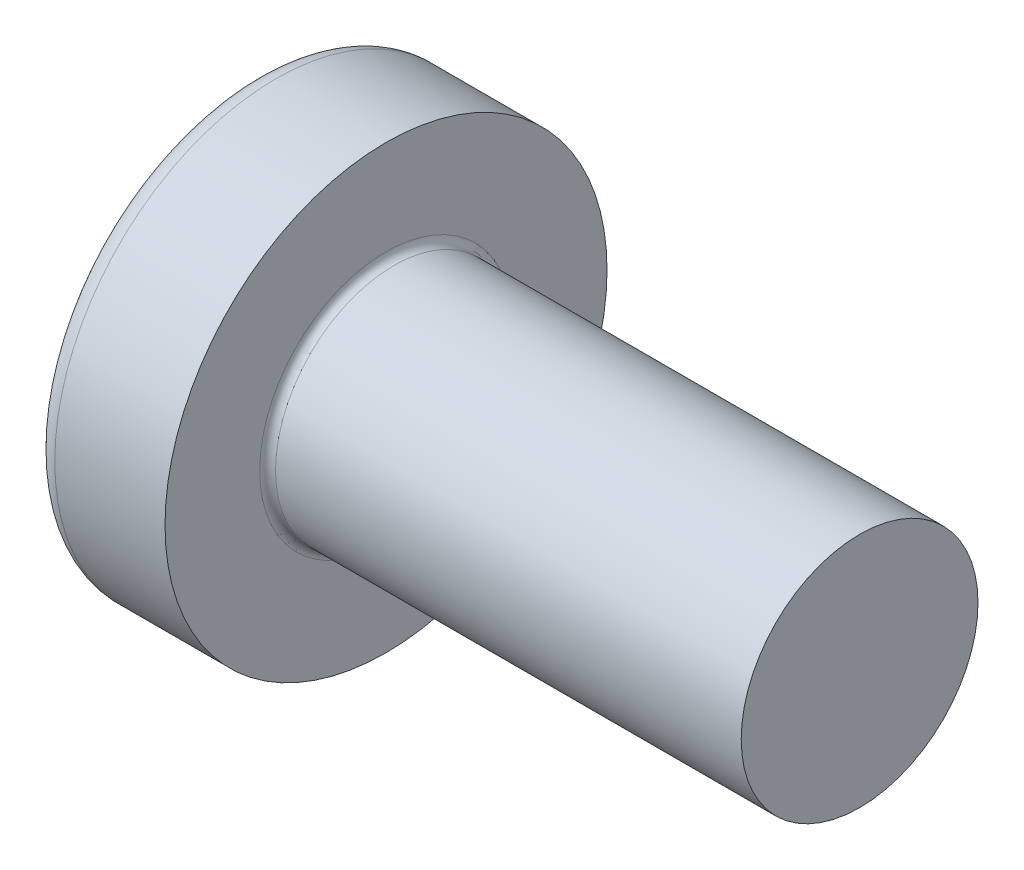
ISO-10303-21;
HEADER;
FILE_DESCRIPTION(('STEP AP214'),'2;1');
FILE_NAME('part.step','',(''),(''),'','','');
FILE_SCHEMA(('AUTOMOTIVE_DESIGN { 1 0 10303 214 1 1 1 1 }'));
ENDSEC;
DATA;
#1=APPLICATION_CONTEXT('core data for automotive mechanical design processes');
#2=APPLICATION_PROTOCOL_DEFINITION('international standard','automotive_design',2000,#1);
#3=PRODUCT_CONTEXT('',#1,'mechanical');
#4=PRODUCT('Part','Part','',(#3));
#5=PRODUCT_RELATED_PRODUCT_CATEGORY('part','',(#4));
#6=PRODUCT_DEFINITION_FORMATION('','',#4);
#7=PRODUCT_DEFINITION_CONTEXT('part definition',#1,'design');
#8=PRODUCT_DEFINITION('design','',#6,#7);
#9=PRODUCT_DEFINITION_SHAPE('','',#8);
#10=(LENGTH_UNIT() NAMED_UNIT(*) SI_UNIT(.MILLI.,.METRE.));
#11=(NAMED_UNIT(*) PLANE_ANGLE_UNIT() SI_UNIT($,.RADIAN.));
#12=(NAMED_UNIT(*) SI_UNIT($,.STERADIAN.) SOLID_ANGLE_UNIT());
#13=UNCERTAINTY_MEASURE_WITH_UNIT(LENGTH_MEASURE(1.E-05),#10,'distance_accuracy_value','');
#14=(GEOMETRIC_REPRESENTATION_CONTEXT(3) GLOBAL_UNCERTAINTY_ASSIGNED_CONTEXT((#13)) GLOBAL_UNIT_ASSIGNED_CONTEXT((#10,
#11,#12)) REPRESENTATION_CONTEXT('',''));
#15=CARTESIAN_POINT('',(0.,0.,0.));
#16=DIRECTION('',(0.,0.,1.));
#17=DIRECTION('',(1.,0.,0.));
#18=AXIS2_PLACEMENT_3D('',#15,#16,#17);
#19=CARTESIAN_POINT('',(5.,0.,0.));
#20=DIRECTION('',(-1.,0.,0.));
#21=DIRECTION('',(0.,1.,0.));
#22=AXIS2_PLACEMENT_3D('',#19,#20,#21);
#23=SPHERICAL_SURFACE('',#22,5.);
#24=CARTESIAN_POINT('',(0.775371598933733,0.,0.));
#25=DIRECTION('',(-1.,0.,0.));
#26=DIRECTION('',(0.,0.,1.));
#27=AXIS2_PLACEMENT_3D('',#24,#25,#26);
#28=CIRCLE('',#27,2.67441860465116);
#29=CARTESIAN_POINT('',(0.775371598933733,0.,2.67441860465116));
#30=VERTEX_POINT('',#29);
#31=EDGE_CURVE('E243',#30,#30,#28,.T.);
#32=ORIENTED_EDGE('',*,*,#31,.T.);
#33=EDGE_LOOP('',(#32));
#34=FACE_BOUND('',#33,.T.);
#35=CARTESIAN_POINT('',(0.0457951200896417,0.,0.));
#36=DIRECTION('',(1.,0.,0.));
#37=DIRECTION('',(0.,0.,-1.));
#38=AXIS2_PLACEMENT_3D('',#35,#36,#37);
#39=CIRCLE('',#38,0.675169614150692);
#40=CARTESIAN_POINT('',(0.0457951200896426,-0.369999999999998,-0.564760133040918));
#41=VERTEX_POINT('',#40);
#42=CARTESIAN_POINT('',(0.0457951200896417,-0.564760133040916,-0.37));
#43=VERTEX_POINT('',#42);
#44=EDGE_CURVE('E379',#41,#43,#39,.F.);
#45=ORIENTED_EDGE('',*,*,#44,.F.);
#46=CARTESIAN_POINT('',(5.,-0.37,0.));
#47=DIRECTION('',(0.,1.,0.));
#48=DIRECTION('',(0.,0.,1.));
#49=AXIS2_PLACEMENT_3D('',#46,#47,#48);
#50=CIRCLE('',#49,4.98629120689917);
#51=CARTESIAN_POINT('',(0.187869731256034,-0.369999999999995,-1.30633161051784));
#52=VERTEX_POINT('',#51);
#53=EDGE_CURVE('E305',#52,#41,#50,.T.);
#54=ORIENTED_EDGE('',*,*,#53,.F.);
#55=CARTESIAN_POINT('',(4.56358245832426,0.,0.875318202045668));
#56=DIRECTION('',(0.446197800778958,0.,-0.89493436774996));
#57=DIRECTION('',(-0.89493436774996,0.,-0.446197800778958));
#58=AXIS2_PLACEMENT_3D('',#55,#56,#57);
#59=CIRCLE('',#58,4.90340267309195);
#60=CARTESIAN_POINT('',(0.187869731256035,0.370000000000005,-1.30633161051784));
#61=VERTEX_POINT('',#60);
#62=EDGE_CURVE('E277',#52,#61,#59,.T.);
#63=ORIENTED_EDGE('',*,*,#62,.T.);
#64=CARTESIAN_POINT('',(5.,0.37,0.));
#65=DIRECTION('',(0.,-1.,0.));
#66=DIRECTION('',(0.,0.,-1.));
#67=AXIS2_PLACEMENT_3D('',#64,#65,#66);
#68=CIRCLE('',#67,4.98629120689917);
#69=CARTESIAN_POINT('',(0.0457951200896421,0.370000000000002,-0.564760133040916));
#70=VERTEX_POINT('',#69);
#71=EDGE_CURVE('E332',#70,#61,#68,.T.);
#72=ORIENTED_EDGE('',*,*,#71,.F.);
#73=CARTESIAN_POINT('',(0.0457951200896417,0.564760133040915,-0.37));
#74=VERTEX_POINT('',#73);
#75=EDGE_CURVE('E398',#74,#70,#39,.F.);
#76=ORIENTED_EDGE('',*,*,#75,.F.);
#77=CARTESIAN_POINT('',(5.,0.,-0.37));
#78=DIRECTION('',(0.,0.,1.));
#79=DIRECTION('',(1.,0.,0.));
#80=AXIS2_PLACEMENT_3D('',#77,#78,#79);
#81=CIRCLE('',#80,4.98629120689917);
#82=CARTESIAN_POINT('',(0.187869731256034,1.30633161051784,-0.37));
#83=VERTEX_POINT('',#82);
#84=EDGE_CURVE('E271',#83,#74,#81,.T.);
#85=ORIENTED_EDGE('',*,*,#84,.F.);
#86=CARTESIAN_POINT('',(4.56358245832426,-0.875318202045668,0.));
#87=DIRECTION('',(0.446197800778958,0.894934367749961,0.));
#88=DIRECTION('',(-0.89493436774996,0.446197800778958,0.));
#89=AXIS2_PLACEMENT_3D('',#86,#87,#88);
#90=CIRCLE('',#89,4.90340267309195);
#91=CARTESIAN_POINT('',(0.187869731256034,1.30633161051784,0.37));
#92=VERTEX_POINT('',#91);
#93=EDGE_CURVE('E274',#83,#92,#90,.T.);
#94=ORIENTED_EDGE('',*,*,#93,.T.);
#95=CARTESIAN_POINT('',(5.,0.,0.37));
#96=DIRECTION('',(0.,0.,-1.));
#97=DIRECTION('',(0.,1.,0.));
#98=AXIS2_PLACEMENT_3D('',#95,#96,#97);
#99=CIRCLE('',#98,4.98629120689917);
#100=CARTESIAN_POINT('',(0.0457951200896417,0.564760133040915,0.37));
#101=VERTEX_POINT('',#100);
#102=EDGE_CURVE('E267',#101,#92,#99,.T.);
#103=ORIENTED_EDGE('',*,*,#102,.F.);
#104=CARTESIAN_POINT('',(0.0457951200896426,0.369999999999998,0.564760133040918));
#105=VERTEX_POINT('',#104);
#106=EDGE_CURVE('E397',#105,#101,#39,.F.);
#107=ORIENTED_EDGE('',*,*,#106,.F.);
#108=CARTESIAN_POINT('',(0.187869731256033,0.369999999999995,1.30633161051784));
#109=VERTEX_POINT('',#108);
#110=EDGE_CURVE('E287',#109,#105,#68,.T.);
#111=ORIENTED_EDGE('',*,*,#110,.F.);
#112=CARTESIAN_POINT('',(4.56358245832426,0.,-0.875318202045669));
#113=DIRECTION('',(0.446197800778958,0.,0.894934367749961));
#114=DIRECTION('',(0.89493436774996,0.,-0.446197800778958));
#115=AXIS2_PLACEMENT_3D('',#112,#113,#114);
#116=CIRCLE('',#115,4.90340267309195);
#117=CARTESIAN_POINT('',(0.187869731256034,-0.370000000000005,1.30633161051784));
#118=VERTEX_POINT('',#117);
#119=EDGE_CURVE('E54',#109,#118,#116,.T.);
#120=ORIENTED_EDGE('',*,*,#119,.T.);
#121=CARTESIAN_POINT('',(0.0457951200896421,-0.370000000000002,0.564760133040916));
#122=VERTEX_POINT('',#121);
#123=EDGE_CURVE('E284',#122,#118,#50,.T.);
#124=ORIENTED_EDGE('',*,*,#123,.F.);
#125=CARTESIAN_POINT('',(0.0457951200896417,-0.564760133040916,0.37));
#126=VERTEX_POINT('',#125);
#127=EDGE_CURVE('E433',#126,#122,#39,.F.);
#128=ORIENTED_EDGE('',*,*,#127,.F.);
#129=CARTESIAN_POINT('',(0.187869731256033,-1.30633161051784,0.37));
#130=VERTEX_POINT('',#129);
#131=EDGE_CURVE('E268',#130,#126,#99,.T.);
#132=ORIENTED_EDGE('',*,*,#131,.F.);
#133=CARTESIAN_POINT('',(4.56358245832426,0.875318202045668,0.));
#134=DIRECTION('',(0.446197800778958,-0.89493436774996,0.));
#135=DIRECTION('',(0.89493436774996,0.446197800778958,0.));
#136=AXIS2_PLACEMENT_3D('',#133,#134,#135);
#137=CIRCLE('',#136,4.90340267309195);
#138=CARTESIAN_POINT('',(0.187869731256033,-1.30633161051784,-0.37));
#139=VERTEX_POINT('',#138);
#140=EDGE_CURVE('E264',#130,#139,#137,.T.);
#141=ORIENTED_EDGE('',*,*,#140,.T.);
#142=EDGE_CURVE('E69',#43,#139,#81,.T.);
#143=ORIENTED_EDGE('',*,*,#142,.F.);
#144=EDGE_LOOP('',(#45,#54,#63,#72,#76,#85,#94,#103,#107,#111,#120,#124,#128,#132,#141,#143));
#145=FACE_BOUND('',#144,.T.);
#146=ADVANCED_FACE('F41',(#34,#145),#23,.T.);
#147=CARTESIAN_POINT('',(1.75,0.527482216012805,-0.37));
#148=DIRECTION('',(0.,0.,1.));
#149=DIRECTION('',(1.,0.,0.));
#150=AXIS2_PLACEMENT_3D('',#147,#148,#149);
#151=PLANE('',#150);
#152=ORIENTED_EDGE('',*,*,#84,.T.);
#153=CARTESIAN_POINT('',(-0.987293237053716,0.649401255967161,-0.37));
#154=CARTESIAN_POINT('',(-0.781914975317084,0.632865887002871,-0.37));
#155=CARTESIAN_POINT('',(-0.576547882393372,0.616188977635081,-0.37));
#156=CARTESIAN_POINT('',(-0.165841599226327,0.582441031964227,-0.37));
#157=CARTESIAN_POINT('',(0.0394975903090452,0.56536998705488,-0.37));
#158=CARTESIAN_POINT('',(0.450133475422572,0.530723441326535,-0.37));
#159=CARTESIAN_POINT('',(0.655430171010573,0.513147940624557,-0.37));
#160=CARTESIAN_POINT('',(1.06596140177934,0.477314957985794,-0.37));
#161=CARTESIAN_POINT('',(1.2711959378071,0.459057485806066,-0.37));
#162=CARTESIAN_POINT('',(1.61065292365626,0.428051938688768,-0.37));
#163=CARTESIAN_POINT('',(1.74490059995643,0.415580824990931,-0.37));
#164=CARTESIAN_POINT('',(2.01334321762763,0.390092023404979,-0.37));
#165=CARTESIAN_POINT('',(2.14753815934577,0.377074339177353,-0.37));
#166=CARTESIAN_POINT('',(2.41586354151957,0.350315629452843,-0.37));
#167=CARTESIAN_POINT('',(2.5499939784531,0.33657456817765,-0.37));
#168=CARTESIAN_POINT('',(2.81814173295471,0.308004077741875,-0.37));
#169=CARTESIAN_POINT('',(2.95215904765134,0.293174621747065,-0.37));
#170=CARTESIAN_POINT('',(3.0860955068368,0.277618485071816,-0.37));
#171=B_SPLINE_CURVE_WITH_KNOTS('',3,(#153,#154,#155,#156,#157,#158,#159,#160,#161,#162,#163,
#164,#165,#166,#167,#168,#169,#170),.UNSPECIFIED.,.F.,.F.,(4,2,2,2,2,2,2,2,4),(0.,
0.618128793984691,1.23627109812525,1.85441325887562,2.4725465791681,2.87702276218609,
3.28149623678161,3.68598973550942,4.09049321032311),.UNSPECIFIED.);
#172=CARTESIAN_POINT('',(1.75,0.415013252800437,-0.370000000000001));
#173=VERTEX_POINT('',#172);
#174=EDGE_CURVE('E419',#74,#173,#171,.T.);
#175=ORIENTED_EDGE('',*,*,#174,.T.);
#176=DIRECTION('',(0.,1.,0.));
#177=VECTOR('',#176,1.);
#178=CARTESIAN_POINT('',(1.75,-0.527482216012805,-0.37));
#179=LINE('',#178,#177);
#180=CARTESIAN_POINT('',(1.75,0.527482216012805,-0.37));
#181=VERTEX_POINT('',#180);
#182=EDGE_CURVE('E361',#173,#181,#179,.T.);
#183=ORIENTED_EDGE('',*,*,#182,.T.);
#184=DIRECTION('',(0.89493436774996,-0.446197800778958,0.));
#185=VECTOR('',#184,1.);
#186=CARTESIAN_POINT('',(0.,1.4,-0.37));
#187=LINE('',#186,#185);
#188=EDGE_CURVE('E244',#83,#181,#187,.T.);
#189=ORIENTED_EDGE('',*,*,#188,.F.);
#190=EDGE_LOOP('',(#152,#175,#183,#189));
#191=FACE_BOUND('',#190,.T.);
#192=ADVANCED_FACE('F199',(#191),#151,.T.);
#193=CARTESIAN_POINT('',(1.75,-0.527482216012805,-0.37));
#194=VERTEX_POINT('',#193);
#195=CARTESIAN_POINT('',(1.75,-0.415013252800437,-0.370000000000001));
#196=VERTEX_POINT('',#195);
#197=EDGE_CURVE('E252',#194,#196,#179,.T.);
#198=ORIENTED_EDGE('',*,*,#197,.T.);
#199=CARTESIAN_POINT('',(-0.987293237053716,-0.649401255967161,-0.37));
#200=CARTESIAN_POINT('',(-0.781914975317084,-0.632865887002871,-0.37));
#201=CARTESIAN_POINT('',(-0.576547882393372,-0.616188977635081,-0.37));
#202=CARTESIAN_POINT('',(-0.165841599226327,-0.582441031964227,-0.37));
#203=CARTESIAN_POINT('',(0.0394975903090452,-0.56536998705488,-0.37));
#204=CARTESIAN_POINT('',(0.450133475422572,-0.530723441326535,-0.37));
#205=CARTESIAN_POINT('',(0.655430171010573,-0.513147940624557,-0.37));
#206=CARTESIAN_POINT('',(1.06596140177934,-0.477314957985794,-0.37));
#207=CARTESIAN_POINT('',(1.2711959378071,-0.459057485806066,-0.37));
#208=CARTESIAN_POINT('',(1.61065292365626,-0.428051938688768,-0.37));
#209=CARTESIAN_POINT('',(1.74490059995643,-0.415580824990931,-0.37));
#210=CARTESIAN_POINT('',(2.01334321762763,-0.390092023404979,-0.37));
#211=CARTESIAN_POINT('',(2.14753815934577,-0.377074339177353,-0.37));
#212=CARTESIAN_POINT('',(2.41586354151957,-0.350315629452843,-0.37));
#213=CARTESIAN_POINT('',(2.5499939784531,-0.33657456817765,-0.37));
#214=CARTESIAN_POINT('',(2.81814173295471,-0.308004077741875,-0.37));
#215=CARTESIAN_POINT('',(2.95215904765134,-0.293174621747065,-0.37));
#216=CARTESIAN_POINT('',(3.0860955068368,-0.277618485071816,-0.37));
#217=B_SPLINE_CURVE_WITH_KNOTS('',3,(#199,#200,#201,#202,#203,#204,#205,#206,#207,#208,#209,
#210,#211,#212,#213,#214,#215,#216),.UNSPECIFIED.,.F.,.F.,(4,2,2,2,2,2,2,2,4),(0.,
0.618128793984691,1.23627109812525,1.85441325887562,2.4725465791681,2.87702276218609,
3.28149623678161,3.68598973550942,4.09049321032311),.UNSPECIFIED.);
#218=EDGE_CURVE('E396',#196,#43,#217,.F.);
#219=ORIENTED_EDGE('',*,*,#218,.T.);
#220=ORIENTED_EDGE('',*,*,#142,.T.);
#221=DIRECTION('',(0.89493436774996,0.446197800778958,0.));
#222=VECTOR('',#221,1.);
#223=CARTESIAN_POINT('',(0.,-1.4,-0.37));
#224=LINE('',#223,#222);
#225=EDGE_CURVE('E335',#139,#194,#224,.T.);
#226=ORIENTED_EDGE('',*,*,#225,.T.);
#227=EDGE_LOOP('',(#198,#219,#220,#226));
#228=FACE_BOUND('',#227,.T.);
#229=ADVANCED_FACE('F205',(#228),#151,.T.);
#230=CARTESIAN_POINT('',(1.75,-0.527482216012805,0.37));
#231=DIRECTION('',(0.,0.,-1.));
#232=DIRECTION('',(0.,1.,0.));
#233=AXIS2_PLACEMENT_3D('',#230,#231,#232);
#234=PLANE('',#233);
#235=DIRECTION('',(0.,-1.,0.));
#236=VECTOR('',#235,1.);
#237=CARTESIAN_POINT('',(1.75,0.527482216012805,0.37));
#238=LINE('',#237,#236);
#239=CARTESIAN_POINT('',(1.75,0.527482216012805,0.37));
#240=VERTEX_POINT('',#239);
#241=CARTESIAN_POINT('',(1.75,0.415013252800437,0.370000000000001));
#242=VERTEX_POINT('',#241);
#243=EDGE_CURVE('E344',#240,#242,#238,.T.);
#244=ORIENTED_EDGE('',*,*,#243,.T.);
#245=CARTESIAN_POINT('',(-0.987293237053716,0.649401255967161,0.37));
#246=CARTESIAN_POINT('',(-0.781914975317084,0.632865887002871,0.37));
#247=CARTESIAN_POINT('',(-0.576547882393372,0.616188977635081,0.37));
#248=CARTESIAN_POINT('',(-0.165841599226327,0.582441031964227,0.37));
#249=CARTESIAN_POINT('',(0.0394975903090453,0.56536998705488,0.37));
#250=CARTESIAN_POINT('',(0.450133475422572,0.530723441326535,0.37));
#251=CARTESIAN_POINT('',(0.655430171010574,0.513147940624557,0.37));
#252=CARTESIAN_POINT('',(1.06596140177934,0.477314957985794,0.37));
#253=CARTESIAN_POINT('',(1.2711959378071,0.459057485806066,0.37));
#254=CARTESIAN_POINT('',(1.61065292365626,0.428051938688768,0.37));
#255=CARTESIAN_POINT('',(1.74490059995643,0.415580824990931,0.37));
#256=CARTESIAN_POINT('',(2.01334321762763,0.39009202340498,0.37));
#257=CARTESIAN_POINT('',(2.14753815934577,0.377074339177353,0.37));
#258=CARTESIAN_POINT('',(2.41586354151957,0.350315629452843,0.37));
#259=CARTESIAN_POINT('',(2.5499939784531,0.33657456817765,0.37));
#260=CARTESIAN_POINT('',(2.81814173295471,0.308004077741875,0.37));
#261=CARTESIAN_POINT('',(2.95215904765134,0.293174621747065,0.37));
#262=CARTESIAN_POINT('',(3.0860955068368,0.277618485071816,0.37));
#263=B_SPLINE_CURVE_WITH_KNOTS('',3,(#245,#246,#247,#248,#249,#250,#251,#252,#253,#254,#255,
#256,#257,#258,#259,#260,#261,#262),.UNSPECIFIED.,.F.,.F.,(4,2,2,2,2,2,2,2,4),(0.,
0.618128793984691,1.23627109812525,1.85441325887562,2.4725465791681,2.87702276218609,
3.28149623678161,3.68598973550942,4.09049321032311),.UNSPECIFIED.);
#264=EDGE_CURVE('E677',#242,#101,#263,.F.);
#265=ORIENTED_EDGE('',*,*,#264,.T.);
#266=ORIENTED_EDGE('',*,*,#102,.T.);
#267=DIRECTION('',(0.89493436774996,-0.446197800778958,0.));
#268=VECTOR('',#267,1.);
#269=CARTESIAN_POINT('',(0.,1.4,0.37));
#270=LINE('',#269,#268);
#271=EDGE_CURVE('E249',#92,#240,#270,.T.);
#272=ORIENTED_EDGE('',*,*,#271,.T.);
#273=EDGE_LOOP('',(#244,#265,#266,#272));
#274=FACE_BOUND('',#273,.T.);
#275=ADVANCED_FACE('F415',(#274),#234,.T.);
#276=ORIENTED_EDGE('',*,*,#131,.T.);
#277=CARTESIAN_POINT('',(-0.987293237069635,-0.649401255968442,0.37));
#278=CARTESIAN_POINT('',(-0.781914975331301,-0.632865887004023,0.37));
#279=CARTESIAN_POINT('',(-0.576547882405888,-0.616188977636102,0.37));
#280=CARTESIAN_POINT('',(-0.16584159923544,-0.582441031964983,0.37));
#281=CARTESIAN_POINT('',(0.0394975903016338,-0.5653699870555,0.37));
#282=CARTESIAN_POINT('',(0.450133475420601,-0.530723441326706,0.37));
#283=CARTESIAN_POINT('',(0.655430171012341,-0.513147940624409,0.37));
#284=CARTESIAN_POINT('',(1.06596140178858,-0.477314957984981,0.37));
#285=CARTESIAN_POINT('',(1.27119593782008,-0.459057485804908,0.37));
#286=CARTESIAN_POINT('',(1.61065292367297,-0.428051938687225,0.37));
#287=CARTESIAN_POINT('',(1.74490059997313,-0.415580824989368,0.37));
#288=CARTESIAN_POINT('',(2.01334321764434,-0.390092023403371,0.37));
#289=CARTESIAN_POINT('',(2.14753815936247,-0.377074339175718,0.37));
#290=CARTESIAN_POINT('',(2.41586354153627,-0.350315629451146,0.37));
#291=CARTESIAN_POINT('',(2.54999397846979,-0.336574568175918,0.37));
#292=CARTESIAN_POINT('',(2.8181417329714,-0.308004077740054,0.37));
#293=CARTESIAN_POINT('',(2.95215904766802,-0.29317462174519,0.37));
#294=CARTESIAN_POINT('',(3.08609550685347,-0.277618485069873,0.37));
#295=B_SPLINE_CURVE_WITH_KNOTS('',3,(#277,#278,#279,#280,#281,#282,#283,#284,#285,#286,#287,
#288,#289,#290,#291,#292,#293,#294),.UNSPECIFIED.,.F.,.F.,(4,2,2,2,2,2,2,2,4),(0.,
0.61812879398981,1.23627109813549,1.85441325889711,2.47254657920086,2.87702276221884,
3.28149623681437,3.68598973554218,4.09049321035586),.UNSPECIFIED.);
#296=CARTESIAN_POINT('',(1.75,-0.415013252800437,0.37));
#297=VERTEX_POINT('',#296);
#298=EDGE_CURVE('E434',#126,#297,#295,.T.);
#299=ORIENTED_EDGE('',*,*,#298,.T.);
#300=CARTESIAN_POINT('',(1.75,-0.527482216012805,0.37));
#301=VERTEX_POINT('',#300);
#302=EDGE_CURVE('E346',#297,#301,#238,.T.);
#303=ORIENTED_EDGE('',*,*,#302,.T.);
#304=DIRECTION('',(0.89493436774996,0.446197800778958,0.));
#305=VECTOR('',#304,1.);
#306=CARTESIAN_POINT('',(0.,-1.4,0.37));
#307=LINE('',#306,#305);
#308=EDGE_CURVE('E337',#130,#301,#307,.T.);
#309=ORIENTED_EDGE('',*,*,#308,.F.);
#310=EDGE_LOOP('',(#276,#299,#303,#309));
#311=FACE_BOUND('',#310,.T.);
#312=ADVANCED_FACE('F525',(#311),#234,.T.);
#313=CARTESIAN_POINT('',(1.75,0.527482216012805,0.37));
#314=DIRECTION('',(0.446197800778958,0.894934367749961,0.));
#315=DIRECTION('',(-0.89493436774996,0.446197800778958,0.));
#316=AXIS2_PLACEMENT_3D('',#313,#314,#315);
#317=PLANE('',#316);
#318=CARTESIAN_POINT('',(2.66965234556629,0.0689604865315897,0.));
#319=DIRECTION('',(0.446197800778958,0.894934367749961,0.));
#320=DIRECTION('',(-0.89493436774996,0.446197800778958,0.));
#321=AXIS2_PLACEMENT_3D('',#318,#319,#320);
#322=ELLIPSE('',#321,1.10195891266117,0.486831719863514);
#323=CARTESIAN_POINT('',(1.75,0.527482216012806,0.175779725196677));
#324=VERTEX_POINT('',#323);
#325=CARTESIAN_POINT('',(1.75,0.527482216012806,-0.175779725196677));
#326=VERTEX_POINT('',#325);
#327=EDGE_CURVE('E310',#324,#326,#322,.F.);
#328=ORIENTED_EDGE('',*,*,#327,.F.);
#329=DIRECTION('',(0.,0.,-1.));
#330=VECTOR('',#329,1.);
#331=CARTESIAN_POINT('',(1.75,0.527482216012805,0.37));
#332=LINE('',#331,#330);
#333=EDGE_CURVE('E347',#240,#324,#332,.T.);
#334=ORIENTED_EDGE('',*,*,#333,.F.);
#335=ORIENTED_EDGE('',*,*,#271,.F.);
#336=ORIENTED_EDGE('',*,*,#93,.F.);
#337=ORIENTED_EDGE('',*,*,#188,.T.);
#338=EDGE_CURVE('E349',#326,#181,#332,.T.);
#339=ORIENTED_EDGE('',*,*,#338,.F.);
#340=EDGE_LOOP('',(#328,#334,#335,#336,#337,#339));
#341=FACE_BOUND('',#340,.T.);
#342=ADVANCED_FACE('F413',(#341),#317,.F.);
#343=CARTESIAN_POINT('',(1.75,-0.527482216012805,-0.37));
#344=DIRECTION('',(0.446197800778958,-0.89493436774996,0.));
#345=DIRECTION('',(0.89493436774996,0.446197800778958,0.));
#346=AXIS2_PLACEMENT_3D('',#343,#344,#345);
#347=PLANE('',#346);
#348=CARTESIAN_POINT('',(2.66965234556629,-0.06896048653159,0.));
#349=DIRECTION('',(0.446197800778958,-0.89493436774996,0.));
#350=DIRECTION('',(-0.89493436774996,-0.446197800778958,0.));
#351=AXIS2_PLACEMENT_3D('',#348,#349,#350);
#352=ELLIPSE('',#351,1.10195891266117,0.486831719863513);
#353=CARTESIAN_POINT('',(1.75,-0.527482216012806,-0.175779725196678));
#354=VERTEX_POINT('',#353);
#355=CARTESIAN_POINT('',(1.75,-0.527482216012806,0.175779725196678));
#356=VERTEX_POINT('',#355);
#357=EDGE_CURVE('E679',#354,#356,#352,.F.);
#358=ORIENTED_EDGE('',*,*,#357,.F.);
#359=DIRECTION('',(0.,0.,1.));
#360=VECTOR('',#359,1.);
#361=CARTESIAN_POINT('',(1.75,-0.527482216012805,-0.37));
#362=LINE('',#361,#360);
#363=EDGE_CURVE('E340',#194,#354,#362,.T.);
#364=ORIENTED_EDGE('',*,*,#363,.F.);
#365=ORIENTED_EDGE('',*,*,#225,.F.);
#366=ORIENTED_EDGE('',*,*,#140,.F.);
#367=ORIENTED_EDGE('',*,*,#308,.T.);
#368=EDGE_CURVE('E343',#356,#301,#362,.T.);
#369=ORIENTED_EDGE('',*,*,#368,.F.);
#370=EDGE_LOOP('',(#358,#364,#365,#366,#367,#369));
#371=FACE_BOUND('',#370,.T.);
#372=ADVANCED_FACE('F512',(#371),#347,.F.);
#373=CARTESIAN_POINT('',(1.75,0.527482216012805,-0.37));
#374=DIRECTION('',(-1.,0.,0.));
#375=DIRECTION('',(0.,0.,1.));
#376=AXIS2_PLACEMENT_3D('',#373,#374,#375);
#377=PLANE('',#376);
#378=DIRECTION('',(0.,1.,0.));
#379=VECTOR('',#378,1.);
#380=CARTESIAN_POINT('',(1.75,-0.370000000000002,0.527482216012804));
#381=LINE('',#380,#379);
#382=CARTESIAN_POINT('',(1.75,-0.370000000000002,0.527482216012804));
#383=VERTEX_POINT('',#382);
#384=CARTESIAN_POINT('',(1.75,-0.175779725196681,0.527482216012805));
#385=VERTEX_POINT('',#384);
#386=EDGE_CURVE('E325',#383,#385,#381,.T.);
#387=ORIENTED_EDGE('',*,*,#386,.T.);
#388=CARTESIAN_POINT('',(1.75,0.,0.));
#389=DIRECTION('',(-1.,0.,0.));
#390=DIRECTION('',(0.,0.,1.));
#391=AXIS2_PLACEMENT_3D('',#388,#389,#390);
#392=CIRCLE('',#391,0.556);
#393=CARTESIAN_POINT('',(1.75,-0.370000000000001,0.415013252800436));
#394=VERTEX_POINT('',#393);
#395=EDGE_CURVE('E705',#394,#385,#392,.T.);
#396=ORIENTED_EDGE('',*,*,#395,.F.);
#397=DIRECTION('',(0.,0.,-1.));
#398=VECTOR('',#397,1.);
#399=CARTESIAN_POINT('',(1.75,-0.370000000000002,0.527482216012804));
#400=LINE('',#399,#398);
#401=EDGE_CURVE('E321',#383,#394,#400,.T.);
#402=ORIENTED_EDGE('',*,*,#401,.F.);
#403=EDGE_LOOP('',(#387,#396,#402));
#404=FACE_BOUND('',#403,.T.);
#405=ADVANCED_FACE('F469',(#404),#377,.T.);
#406=ORIENTED_EDGE('',*,*,#302,.F.);
#407=EDGE_CURVE('E710',#356,#297,#392,.T.);
#408=ORIENTED_EDGE('',*,*,#407,.F.);
#409=ORIENTED_EDGE('',*,*,#368,.T.);
#410=EDGE_LOOP('',(#406,#408,#409));
#411=FACE_BOUND('',#410,.T.);
#412=ADVANCED_FACE('F499',(#411),#377,.T.);
#413=ORIENTED_EDGE('',*,*,#363,.T.);
#414=EDGE_CURVE('E390',#196,#354,#392,.T.);
#415=ORIENTED_EDGE('',*,*,#414,.F.);
#416=ORIENTED_EDGE('',*,*,#197,.F.);
#417=EDGE_LOOP('',(#413,#415,#416));
#418=FACE_BOUND('',#417,.T.);
#419=ADVANCED_FACE('F493',(#418),#377,.T.);
#420=CARTESIAN_POINT('',(1.75,-0.369999999999998,-0.415013252800438));
#421=VERTEX_POINT('',#420);
#422=CARTESIAN_POINT('',(1.75,-0.369999999999998,-0.527482216012807));
#423=VERTEX_POINT('',#422);
#424=EDGE_CURVE('E324',#421,#423,#400,.T.);
#425=ORIENTED_EDGE('',*,*,#424,.F.);
#426=CARTESIAN_POINT('',(1.75,-0.175779725196678,-0.527482216012806));
#427=VERTEX_POINT('',#426);
#428=EDGE_CURVE('E61',#427,#421,#392,.T.);
#429=ORIENTED_EDGE('',*,*,#428,.F.);
#430=DIRECTION('',(0.,-1.,0.));
#431=VECTOR('',#430,1.);
#432=CARTESIAN_POINT('',(1.75,0.370000000000002,-0.527482216012804));
#433=LINE('',#432,#431);
#434=EDGE_CURVE('E320',#427,#423,#433,.T.);
#435=ORIENTED_EDGE('',*,*,#434,.T.);
#436=EDGE_LOOP('',(#425,#429,#435));
#437=FACE_BOUND('',#436,.T.);
#438=ADVANCED_FACE('F385',(#437),#377,.T.);
#439=CARTESIAN_POINT('',(1.75,0.370000000000002,-0.527482216012804));
#440=VERTEX_POINT('',#439);
#441=CARTESIAN_POINT('',(1.75,0.175779725196681,-0.527482216012805));
#442=VERTEX_POINT('',#441);
#443=EDGE_CURVE('E317',#440,#442,#433,.T.);
#444=ORIENTED_EDGE('',*,*,#443,.T.);
#445=CARTESIAN_POINT('',(1.75,0.370000000000001,-0.415013252800436));
#446=VERTEX_POINT('',#445);
#447=EDGE_CURVE('E389',#446,#442,#392,.T.);
#448=ORIENTED_EDGE('',*,*,#447,.F.);
#449=DIRECTION('',(0.,0.,1.));
#450=VECTOR('',#449,1.);
#451=CARTESIAN_POINT('',(1.75,0.370000000000002,-0.527482216012804));
#452=LINE('',#451,#450);
#453=EDGE_CURVE('E329',#440,#446,#452,.T.);
#454=ORIENTED_EDGE('',*,*,#453,.F.);
#455=EDGE_LOOP('',(#444,#448,#454));
#456=FACE_BOUND('',#455,.T.);
#457=ADVANCED_FACE('F481',(#456),#377,.T.);
#458=ORIENTED_EDGE('',*,*,#182,.F.);
#459=EDGE_CURVE('E694',#326,#173,#392,.T.);
#460=ORIENTED_EDGE('',*,*,#459,.F.);
#461=ORIENTED_EDGE('',*,*,#338,.T.);
#462=EDGE_LOOP('',(#458,#460,#461));
#463=FACE_BOUND('',#462,.T.);
#464=ADVANCED_FACE('F475',(#463),#377,.T.);
#465=ORIENTED_EDGE('',*,*,#333,.T.);
#466=EDGE_CURVE('E696',#242,#324,#392,.T.);
#467=ORIENTED_EDGE('',*,*,#466,.F.);
#468=ORIENTED_EDGE('',*,*,#243,.F.);
#469=EDGE_LOOP('',(#465,#467,#468));
#470=FACE_BOUND('',#469,.T.);
#471=ADVANCED_FACE('F467',(#470),#377,.T.);
#472=CARTESIAN_POINT('',(1.75,0.369999999999999,0.415013252800439));
#473=VERTEX_POINT('',#472);
#474=CARTESIAN_POINT('',(1.75,0.369999999999998,0.527482216012807));
#475=VERTEX_POINT('',#474);
#476=EDGE_CURVE('E302',#473,#475,#452,.T.);
#477=ORIENTED_EDGE('',*,*,#476,.F.);
#478=CARTESIAN_POINT('',(1.75,0.175779725196678,0.527482216012806));
#479=VERTEX_POINT('',#478);
#480=EDGE_CURVE('E391',#479,#473,#392,.T.);
#481=ORIENTED_EDGE('',*,*,#480,.F.);
#482=EDGE_CURVE('E328',#479,#475,#381,.T.);
#483=ORIENTED_EDGE('',*,*,#482,.T.);
#484=EDGE_LOOP('',(#477,#481,#483));
#485=FACE_BOUND('',#484,.T.);
#486=ADVANCED_FACE('F461',(#485),#377,.T.);
#487=CARTESIAN_POINT('',(1.75,0.369999999999998,0.527482216012806));
#488=DIRECTION('',(0.,-1.,0.));
#489=DIRECTION('',(1.,0.,0.));
#490=AXIS2_PLACEMENT_3D('',#487,#488,#489);
#491=PLANE('',#490);
#492=ORIENTED_EDGE('',*,*,#110,.T.);
#493=CARTESIAN_POINT('',(-0.987293237069635,0.369999999999998,0.649401255968443));
#494=CARTESIAN_POINT('',(-0.781914975331301,0.369999999999998,0.632865887004024));
#495=CARTESIAN_POINT('',(-0.576547882405888,0.369999999999998,0.616188977636103));
#496=CARTESIAN_POINT('',(-0.16584159923544,0.369999999999998,0.582441031964984));
#497=CARTESIAN_POINT('',(0.0394975903016338,0.369999999999998,0.565369987055501));
#498=CARTESIAN_POINT('',(0.450133475420601,0.369999999999998,0.530723441326707));
#499=CARTESIAN_POINT('',(0.655430171012341,0.369999999999998,0.51314794062441));
#500=CARTESIAN_POINT('',(1.06596140178858,0.369999999999998,0.477314957984982));
#501=CARTESIAN_POINT('',(1.27119593782008,0.369999999999998,0.459057485804909));
#502=CARTESIAN_POINT('',(1.61065292367297,0.369999999999999,0.428051938687226));
#503=CARTESIAN_POINT('',(1.74490059997313,0.369999999999999,0.415580824989369));
#504=CARTESIAN_POINT('',(2.01334321764434,0.369999999999999,0.390092023403372));
#505=CARTESIAN_POINT('',(2.14753815936247,0.369999999999999,0.37707433917572));
#506=CARTESIAN_POINT('',(2.41586354153627,0.369999999999999,0.350315629451147));
#507=CARTESIAN_POINT('',(2.54999397846979,0.369999999999999,0.336574568175919));
#508=CARTESIAN_POINT('',(2.8181417329714,0.369999999999999,0.308004077740055));
#509=CARTESIAN_POINT('',(2.95215904766802,0.369999999999999,0.293174621745191));
#510=CARTESIAN_POINT('',(3.08609550685347,0.369999999999999,0.277618485069875));
#511=B_SPLINE_CURVE_WITH_KNOTS('',3,(#493,#494,#495,#496,#497,#498,#499,#500,#501,#502,#503,
#504,#505,#506,#507,#508,#509,#510),.UNSPECIFIED.,.F.,.F.,(4,2,2,2,2,2,2,2,4),(0.,
0.61812879398981,1.23627109813549,1.85441325889711,2.47254657920086,2.87702276221884,
3.28149623681436,3.68598973554218,4.09049321035586),.UNSPECIFIED.);
#512=EDGE_CURVE('E676',#105,#473,#511,.T.);
#513=ORIENTED_EDGE('',*,*,#512,.T.);
#514=ORIENTED_EDGE('',*,*,#476,.T.);
#515=DIRECTION('',(0.89493436774996,0.,-0.446197800778958));
#516=VECTOR('',#515,1.);
#517=CARTESIAN_POINT('',(0.,0.369999999999995,1.4));
#518=LINE('',#517,#516);
#519=EDGE_CURVE('E295',#109,#475,#518,.T.);
#520=ORIENTED_EDGE('',*,*,#519,.F.);
#521=EDGE_LOOP('',(#492,#513,#514,#520));
#522=FACE_BOUND('',#521,.T.);
#523=ADVANCED_FACE('F299',(#522),#491,.T.);
#524=CARTESIAN_POINT('',(1.75,-0.369999999999998,-0.527482216012807));
#525=DIRECTION('',(0.,1.,0.));
#526=DIRECTION('',(0.,0.,1.));
#527=AXIS2_PLACEMENT_3D('',#524,#525,#526);
#528=PLANE('',#527);
#529=ORIENTED_EDGE('',*,*,#401,.T.);
#530=CARTESIAN_POINT('',(-0.987293237053716,-0.370000000000002,0.64940125596716));
#531=CARTESIAN_POINT('',(-0.781914975317084,-0.370000000000002,0.63286588700287));
#532=CARTESIAN_POINT('',(-0.576547882393372,-0.370000000000002,0.61618897763508));
#533=CARTESIAN_POINT('',(-0.165841599226327,-0.370000000000002,0.582441031964225));
#534=CARTESIAN_POINT('',(0.0394975903090451,-0.370000000000002,0.565369987054878));
#535=CARTESIAN_POINT('',(0.450133475422572,-0.370000000000002,0.530723441326533));
#536=CARTESIAN_POINT('',(0.655430171010573,-0.370000000000002,0.513147940624555));
#537=CARTESIAN_POINT('',(1.06596140177934,-0.370000000000002,0.477314957985793));
#538=CARTESIAN_POINT('',(1.2711959378071,-0.370000000000002,0.459057485806065));
#539=CARTESIAN_POINT('',(1.61065292365626,-0.370000000000001,0.428051938688767));
#540=CARTESIAN_POINT('',(1.74490059995642,-0.370000000000001,0.41558082499093));
#541=CARTESIAN_POINT('',(2.01334321762763,-0.370000000000001,0.390092023404978));
#542=CARTESIAN_POINT('',(2.14753815934577,-0.370000000000001,0.377074339177352));
#543=CARTESIAN_POINT('',(2.41586354151957,-0.370000000000001,0.350315629452841));
#544=CARTESIAN_POINT('',(2.5499939784531,-0.370000000000001,0.336574568177649));
#545=CARTESIAN_POINT('',(2.81814173295471,-0.370000000000001,0.308004077741874));
#546=CARTESIAN_POINT('',(2.95215904765134,-0.370000000000001,0.293174621747063));
#547=CARTESIAN_POINT('',(3.0860955068368,-0.370000000000001,0.277618485071814));
#548=B_SPLINE_CURVE_WITH_KNOTS('',3,(#530,#531,#532,#533,#534,#535,#536,#537,#538,#539,#540,
#541,#542,#543,#544,#545,#546,#547),.UNSPECIFIED.,.F.,.F.,(4,2,2,2,2,2,2,2,4),(0.,
0.618128793984691,1.23627109812525,1.85441325887562,2.4725465791681,2.87702276218609,
3.28149623678161,3.68598973550942,4.09049321032311),.UNSPECIFIED.);
#549=EDGE_CURVE('E427',#394,#122,#548,.F.);
#550=ORIENTED_EDGE('',*,*,#549,.T.);
#551=ORIENTED_EDGE('',*,*,#123,.T.);
#552=DIRECTION('',(0.89493436774996,0.,-0.446197800778958));
#553=VECTOR('',#552,1.);
#554=CARTESIAN_POINT('',(0.,-0.370000000000005,1.4));
#555=LINE('',#554,#553);
#556=EDGE_CURVE('E297',#118,#383,#555,.T.);
#557=ORIENTED_EDGE('',*,*,#556,.T.);
#558=EDGE_LOOP('',(#529,#550,#551,#557));
#559=FACE_BOUND('',#558,.T.);
#560=ADVANCED_FACE('F234',(#559),#528,.T.);
#561=CARTESIAN_POINT('',(1.75,-0.370000000000002,0.527482216012804));
#562=DIRECTION('',(0.446197800778958,0.,0.894934367749961));
#563=DIRECTION('',(-0.89493436774996,0.,0.446197800778958));
#564=AXIS2_PLACEMENT_3D('',#561,#562,#563);
#565=PLANE('',#564);
#566=CARTESIAN_POINT('',(2.66965234556629,0.,0.0689604865315897));
#567=DIRECTION('',(0.446197800778958,0.,0.894934367749961));
#568=DIRECTION('',(-0.89493436774996,0.,0.446197800778958));
#569=AXIS2_PLACEMENT_3D('',#566,#567,#568);
#570=ELLIPSE('',#569,1.10195891266117,0.486831719863514);
#571=EDGE_CURVE('E425',#385,#479,#570,.F.);
#572=ORIENTED_EDGE('',*,*,#571,.F.);
#573=ORIENTED_EDGE('',*,*,#386,.F.);
#574=ORIENTED_EDGE('',*,*,#556,.F.);
#575=ORIENTED_EDGE('',*,*,#119,.F.);
#576=ORIENTED_EDGE('',*,*,#519,.T.);
#577=ORIENTED_EDGE('',*,*,#482,.F.);
#578=EDGE_LOOP('',(#572,#573,#574,#575,#576,#577));
#579=FACE_BOUND('',#578,.T.);
#580=ADVANCED_FACE('F293',(#579),#565,.F.);
#581=CARTESIAN_POINT('',(1.75,0.370000000000002,-0.527482216012804));
#582=DIRECTION('',(0.446197800778958,0.,-0.89493436774996));
#583=DIRECTION('',(0.89493436774996,0.,0.446197800778958));
#584=AXIS2_PLACEMENT_3D('',#581,#582,#583);
#585=PLANE('',#584);
#586=CARTESIAN_POINT('',(2.66965234556629,0.,-0.0689604865315901));
#587=DIRECTION('',(0.446197800778958,0.,-0.89493436774996));
#588=DIRECTION('',(-0.89493436774996,0.,-0.446197800778958));
#589=AXIS2_PLACEMENT_3D('',#586,#587,#588);
#590=ELLIPSE('',#589,1.10195891266117,0.486831719863513);
#591=EDGE_CURVE('E383',#442,#427,#590,.F.);
#592=ORIENTED_EDGE('',*,*,#591,.F.);
#593=ORIENTED_EDGE('',*,*,#443,.F.);
#594=DIRECTION('',(0.89493436774996,0.,0.446197800778958));
#595=VECTOR('',#594,1.);
#596=CARTESIAN_POINT('',(0.,0.370000000000005,-1.4));
#597=LINE('',#596,#595);
#598=EDGE_CURVE('E307',#61,#440,#597,.T.);
#599=ORIENTED_EDGE('',*,*,#598,.F.);
#600=ORIENTED_EDGE('',*,*,#62,.F.);
#601=DIRECTION('',(0.89493436774996,0.,0.446197800778958));
#602=VECTOR('',#601,1.);
#603=CARTESIAN_POINT('',(0.,-0.369999999999995,-1.4));
#604=LINE('',#603,#602);
#605=EDGE_CURVE('E314',#52,#423,#604,.T.);
#606=ORIENTED_EDGE('',*,*,#605,.T.);
#607=ORIENTED_EDGE('',*,*,#434,.F.);
#608=EDGE_LOOP('',(#592,#593,#599,#600,#606,#607));
#609=FACE_BOUND('',#608,.T.);
#610=ADVANCED_FACE('F374',(#609),#585,.F.);
#611=ORIENTED_EDGE('',*,*,#453,.T.);
#612=CARTESIAN_POINT('',(-0.987293237053716,0.370000000000002,-0.649401255967159));
#613=CARTESIAN_POINT('',(-0.781914975317084,0.370000000000002,-0.63286588700287));
#614=CARTESIAN_POINT('',(-0.576547882393372,0.370000000000002,-0.61618897763508));
#615=CARTESIAN_POINT('',(-0.165841599226327,0.370000000000002,-0.582441031964225));
#616=CARTESIAN_POINT('',(0.039497590309045,0.370000000000002,-0.565369987054878));
#617=CARTESIAN_POINT('',(0.450133475422572,0.370000000000002,-0.530723441326533));
#618=CARTESIAN_POINT('',(0.655430171010573,0.370000000000002,-0.513147940624555));
#619=CARTESIAN_POINT('',(1.06596140177934,0.370000000000002,-0.477314957985793));
#620=CARTESIAN_POINT('',(1.2711959378071,0.370000000000002,-0.459057485806065));
#621=CARTESIAN_POINT('',(1.61065292365626,0.370000000000001,-0.428051938688767));
#622=CARTESIAN_POINT('',(1.74490059995642,0.370000000000001,-0.41558082499093));
#623=CARTESIAN_POINT('',(2.01334321762763,0.370000000000001,-0.390092023404978));
#624=CARTESIAN_POINT('',(2.14753815934577,0.370000000000001,-0.377074339177352));
#625=CARTESIAN_POINT('',(2.41586354151957,0.370000000000001,-0.350315629452841));
#626=CARTESIAN_POINT('',(2.5499939784531,0.370000000000001,-0.336574568177649));
#627=CARTESIAN_POINT('',(2.81814173295471,0.370000000000001,-0.308004077741874));
#628=CARTESIAN_POINT('',(2.95215904765134,0.370000000000001,-0.293174621747064));
#629=CARTESIAN_POINT('',(3.0860955068368,0.370000000000001,-0.277618485071814));
#630=B_SPLINE_CURVE_WITH_KNOTS('',3,(#612,#613,#614,#615,#616,#617,#618,#619,#620,#621,#622,
#623,#624,#625,#626,#627,#628,#629),.UNSPECIFIED.,.F.,.F.,(4,2,2,2,2,2,2,2,4),(0.,
0.618128793984691,1.23627109812525,1.85441325887562,2.4725465791681,2.87702276218609,
3.28149623678161,3.68598973550942,4.09049321032311),.UNSPECIFIED.);
#631=EDGE_CURVE('E370',#446,#70,#630,.F.);
#632=ORIENTED_EDGE('',*,*,#631,.T.);
#633=ORIENTED_EDGE('',*,*,#71,.T.);
#634=ORIENTED_EDGE('',*,*,#598,.T.);
#635=EDGE_LOOP('',(#611,#632,#633,#634));
#636=FACE_BOUND('',#635,.T.);
#637=ADVANCED_FACE('F232',(#636),#491,.T.);
#638=ORIENTED_EDGE('',*,*,#53,.T.);
#639=CARTESIAN_POINT('',(-0.987293237069635,-0.369999999999997,-0.649401255968443));
#640=CARTESIAN_POINT('',(-0.781914975331301,-0.369999999999997,-0.632865887004025));
#641=CARTESIAN_POINT('',(-0.576547882405888,-0.369999999999997,-0.616188977636104));
#642=CARTESIAN_POINT('',(-0.16584159923544,-0.369999999999998,-0.582441031964984));
#643=CARTESIAN_POINT('',(0.0394975903016337,-0.369999999999998,-0.565369987055501));
#644=CARTESIAN_POINT('',(0.450133475420601,-0.369999999999998,-0.530723441326707));
#645=CARTESIAN_POINT('',(0.655430171012341,-0.369999999999998,-0.51314794062441));
#646=CARTESIAN_POINT('',(1.06596140178858,-0.369999999999998,-0.477314957984982));
#647=CARTESIAN_POINT('',(1.27119593782008,-0.369999999999998,-0.459057485804909));
#648=CARTESIAN_POINT('',(1.61065292367297,-0.369999999999998,-0.428051938687226));
#649=CARTESIAN_POINT('',(1.74490059997313,-0.369999999999998,-0.415580824989369));
#650=CARTESIAN_POINT('',(2.01334321764434,-0.369999999999999,-0.390092023403372));
#651=CARTESIAN_POINT('',(2.14753815936247,-0.369999999999999,-0.37707433917572));
#652=CARTESIAN_POINT('',(2.41586354153627,-0.369999999999999,-0.350315629451147));
#653=CARTESIAN_POINT('',(2.54999397846979,-0.369999999999999,-0.336574568175919));
#654=CARTESIAN_POINT('',(2.8181417329714,-0.369999999999999,-0.308004077740055));
#655=CARTESIAN_POINT('',(2.95215904766802,-0.369999999999999,-0.293174621745191));
#656=CARTESIAN_POINT('',(3.08609550685347,-0.369999999999999,-0.277618485069875));
#657=B_SPLINE_CURVE_WITH_KNOTS('',3,(#639,#640,#641,#642,#643,#644,#645,#646,#647,#648,#649,
#650,#651,#652,#653,#654,#655,#656),.UNSPECIFIED.,.F.,.F.,(4,2,2,2,2,2,2,2,4),(0.,
0.61812879398981,1.23627109813549,1.85441325889711,2.47254657920086,2.87702276221884,
3.28149623681436,3.68598973554218,4.09049321035586),.UNSPECIFIED.);
#658=EDGE_CURVE('E11',#41,#421,#657,.T.);
#659=ORIENTED_EDGE('',*,*,#658,.T.);
#660=ORIENTED_EDGE('',*,*,#424,.T.);
#661=ORIENTED_EDGE('',*,*,#605,.F.);
#662=EDGE_LOOP('',(#638,#659,#660,#661));
#663=FACE_BOUND('',#662,.T.);
#664=ADVANCED_FACE('F227',(#663),#528,.T.);
#665=CARTESIAN_POINT('',(-25.4,0.,0.));
#666=DIRECTION('',(-1.,0.,0.));
#667=DIRECTION('',(0.,0.,1.));
#668=AXIS2_PLACEMENT_3D('',#665,#666,#667);
#669=CYLINDRICAL_SURFACE('',#668,1.5);
#670=CARTESIAN_POINT('',(2.5,0.,0.));
#671=DIRECTION('',(-1.,0.,0.));
#672=DIRECTION('',(0.,0.,1.));
#673=AXIS2_PLACEMENT_3D('',#670,#671,#672);
#674=CIRCLE('',#673,1.5);
#675=CARTESIAN_POINT('',(2.5,0.,1.5));
#676=VERTEX_POINT('',#675);
#677=EDGE_CURVE('E238',#676,#676,#674,.F.);
#678=ORIENTED_EDGE('',*,*,#677,.T.);
#679=EDGE_LOOP('',(#678));
#680=FACE_BOUND('',#679,.T.);
#681=CARTESIAN_POINT('',(8.4,0.,0.));
#682=DIRECTION('',(-1.,0.,0.));
#683=DIRECTION('',(0.,0.,1.));
#684=AXIS2_PLACEMENT_3D('',#681,#682,#683);
#685=CIRCLE('',#684,1.5);
#686=CARTESIAN_POINT('',(8.4,0.,1.5));
#687=VERTEX_POINT('',#686);
#688=EDGE_CURVE('E241',#687,#687,#685,.T.);
#689=ORIENTED_EDGE('',*,*,#688,.T.);
#690=EDGE_LOOP('',(#689));
#691=FACE_BOUND('',#690,.T.);
#692=ADVANCED_FACE('F224',(#680,#691),#669,.T.);
#693=CARTESIAN_POINT('',(2.4,1.5,0.));
#694=DIRECTION('',(-1.,0.,0.));
#695=DIRECTION('',(0.,0.,1.));
#696=AXIS2_PLACEMENT_3D('',#693,#694,#695);
#697=PLANE('',#696);
#698=CARTESIAN_POINT('',(2.4,0.,0.));
#699=DIRECTION('',(-1.,0.,0.));
#700=DIRECTION('',(0.,0.,1.));
#701=AXIS2_PLACEMENT_3D('',#698,#699,#700);
#702=CIRCLE('',#701,1.6);
#703=CARTESIAN_POINT('',(2.4,0.,1.6));
#704=VERTEX_POINT('',#703);
#705=EDGE_CURVE('E260',#704,#704,#702,.T.);
#706=ORIENTED_EDGE('',*,*,#705,.T.);
#707=EDGE_LOOP('',(#706));
#708=FACE_BOUND('',#707,.T.);
#709=CARTESIAN_POINT('',(2.4,0.,0.));
#710=DIRECTION('',(-1.,0.,0.));
#711=DIRECTION('',(0.,0.,1.));
#712=AXIS2_PLACEMENT_3D('',#709,#710,#711);
#713=CIRCLE('',#712,2.8);
#714=CARTESIAN_POINT('',(2.4,0.,2.8));
#715=VERTEX_POINT('',#714);
#716=EDGE_CURVE('E257',#715,#715,#713,.T.);
#717=ORIENTED_EDGE('',*,*,#716,.F.);
#718=EDGE_LOOP('',(#717));
#719=FACE_BOUND('',#718,.T.);
#720=ADVANCED_FACE('F221',(#708,#719),#697,.F.);
#721=CARTESIAN_POINT('',(-25.4,0.,0.));
#722=DIRECTION('',(-1.,0.,0.));
#723=DIRECTION('',(0.,0.,1.));
#724=AXIS2_PLACEMENT_3D('',#721,#722,#723);
#725=CYLINDRICAL_SURFACE('',#724,2.8);
#726=ORIENTED_EDGE('',*,*,#716,.T.);
#727=EDGE_LOOP('',(#726));
#728=FACE_BOUND('',#727,.T.);
#729=CARTESIAN_POINT('',(1.00350153259131,0.,0.));
#730=DIRECTION('',(-1.,0.,0.));
#731=DIRECTION('',(0.,0.,1.));
#732=AXIS2_PLACEMENT_3D('',#729,#730,#731);
#733=CIRCLE('',#732,2.8);
#734=CARTESIAN_POINT('',(1.00350153259131,0.,2.8));
#735=VERTEX_POINT('',#734);
#736=EDGE_CURVE('E246',#735,#735,#733,.T.);
#737=ORIENTED_EDGE('',*,*,#736,.F.);
#738=EDGE_LOOP('',(#737));
#739=FACE_BOUND('',#738,.T.);
#740=ADVANCED_FACE('F217',(#728,#739),#725,.T.);
#741=CARTESIAN_POINT('',(1.00350153259131,0.,0.));
#742=DIRECTION('',(-1.,0.,0.));
#743=DIRECTION('',(0.,0.,1.));
#744=AXIS2_PLACEMENT_3D('',#741,#742,#743);
#745=TOROIDAL_SURFACE('',#744,2.53,0.270000000000001);
#746=ORIENTED_EDGE('',*,*,#736,.T.);
#747=EDGE_LOOP('',(#746));
#748=FACE_BOUND('',#747,.T.);
#749=ORIENTED_EDGE('',*,*,#31,.F.);
#750=EDGE_LOOP('',(#749));
#751=FACE_BOUND('',#750,.T.);
#752=ADVANCED_FACE('F214',(#748,#751),#745,.T.);
#753=CARTESIAN_POINT('',(8.4,1.5,0.));
#754=DIRECTION('',(1.,0.,0.));
#755=DIRECTION('',(0.,0.,-1.));
#756=AXIS2_PLACEMENT_3D('',#753,#754,#755);
#757=PLANE('',#756);
#758=ORIENTED_EDGE('',*,*,#688,.F.);
#759=EDGE_LOOP('',(#758));
#760=FACE_BOUND('',#759,.T.);
#761=ADVANCED_FACE('F212',(#760),#757,.T.);
#762=CARTESIAN_POINT('',(2.5,0.,0.));
#763=DIRECTION('',(-1.,0.,0.));
#764=DIRECTION('',(0.,0.,1.));
#765=AXIS2_PLACEMENT_3D('',#762,#763,#764);
#766=TOROIDAL_SURFACE('',#765,1.6,0.1);
#767=ORIENTED_EDGE('',*,*,#677,.F.);
#768=EDGE_LOOP('',(#767));
#769=FACE_BOUND('',#768,.T.);
#770=ORIENTED_EDGE('',*,*,#705,.F.);
#771=EDGE_LOOP('',(#770));
#772=FACE_BOUND('',#771,.T.);
#773=ADVANCED_FACE('F43',(#769,#772),#766,.F.);
#774=CARTESIAN_POINT('',(1.75,0.,0.));
#775=DIRECTION('',(-1.,0.,0.));
#776=DIRECTION('',(0.,0.,1.));
#777=AXIS2_PLACEMENT_3D('',#774,#775,#776);
#778=CONICAL_SURFACE('',#777,0.556,0.0698131700797659);
#779=ORIENTED_EDGE('',*,*,#327,.T.);
#780=EDGE_CURVE('E691',#324,#326,#392,.T.);
#781=ORIENTED_EDGE('',*,*,#780,.F.);
#782=EDGE_LOOP('',(#779,#781));
#783=FACE_BOUND('',#782,.T.);
#784=ADVANCED_FACE('F196',(#783),#778,.F.);
#785=ORIENTED_EDGE('',*,*,#357,.T.);
#786=EDGE_CURVE('E711',#354,#356,#392,.T.);
#787=ORIENTED_EDGE('',*,*,#786,.F.);
#788=EDGE_LOOP('',(#785,#787));
#789=FACE_BOUND('',#788,.T.);
#790=ADVANCED_FACE('F606',(#789),#778,.F.);
#791=EDGE_CURVE('E393',#473,#242,#392,.T.);
#792=ORIENTED_EDGE('',*,*,#791,.F.);
#793=ORIENTED_EDGE('',*,*,#512,.F.);
#794=ORIENTED_EDGE('',*,*,#106,.T.);
#795=ORIENTED_EDGE('',*,*,#264,.F.);
#796=EDGE_LOOP('',(#792,#793,#794,#795));
#797=FACE_BOUND('',#796,.T.);
#798=ADVANCED_FACE('F613',(#797),#778,.F.);
#799=ORIENTED_EDGE('',*,*,#571,.T.);
#800=EDGE_CURVE('E394',#385,#479,#392,.T.);
#801=ORIENTED_EDGE('',*,*,#800,.F.);
#802=EDGE_LOOP('',(#799,#801));
#803=FACE_BOUND('',#802,.T.);
#804=ADVANCED_FACE('F620',(#803),#778,.F.);
#805=ORIENTED_EDGE('',*,*,#591,.T.);
#806=EDGE_CURVE('E386',#442,#427,#392,.T.);
#807=ORIENTED_EDGE('',*,*,#806,.F.);
#808=EDGE_LOOP('',(#805,#807));
#809=FACE_BOUND('',#808,.T.);
#810=ADVANCED_FACE('F627',(#809),#778,.F.);
#811=ORIENTED_EDGE('',*,*,#127,.T.);
#812=ORIENTED_EDGE('',*,*,#549,.F.);
#813=EDGE_CURVE('E707',#297,#394,#392,.T.);
#814=ORIENTED_EDGE('',*,*,#813,.F.);
#815=ORIENTED_EDGE('',*,*,#298,.F.);
#816=EDGE_LOOP('',(#811,#812,#814,#815));
#817=FACE_BOUND('',#816,.T.);
#818=ADVANCED_FACE('F634',(#817),#778,.F.);
#819=ORIENTED_EDGE('',*,*,#75,.T.);
#820=ORIENTED_EDGE('',*,*,#631,.F.);
#821=EDGE_CURVE('E697',#173,#446,#392,.T.);
#822=ORIENTED_EDGE('',*,*,#821,.F.);
#823=ORIENTED_EDGE('',*,*,#174,.F.);
#824=EDGE_LOOP('',(#819,#820,#822,#823));
#825=FACE_BOUND('',#824,.T.);
#826=ADVANCED_FACE('F194',(#825),#778,.F.);
#827=EDGE_CURVE('E387',#421,#196,#392,.T.);
#828=ORIENTED_EDGE('',*,*,#827,.F.);
#829=ORIENTED_EDGE('',*,*,#658,.F.);
#830=ORIENTED_EDGE('',*,*,#44,.T.);
#831=ORIENTED_EDGE('',*,*,#218,.F.);
#832=EDGE_LOOP('',(#828,#829,#830,#831));
#833=FACE_BOUND('',#832,.T.);
#834=ADVANCED_FACE('F189',(#833),#778,.F.);
#835=CARTESIAN_POINT('',(1.93065535110549,0.,0.));
#836=DIRECTION('',(-1.,0.,0.));
#837=DIRECTION('',(0.,0.,1.));
#838=AXIS2_PLACEMENT_3D('',#835,#836,#837);
#839=CONICAL_SURFACE('',#838,0.,1.25663706143592);
#840=ORIENTED_EDGE('',*,*,#480,.T.);
#841=ORIENTED_EDGE('',*,*,#791,.T.);
#842=ORIENTED_EDGE('',*,*,#466,.T.);
#843=ORIENTED_EDGE('',*,*,#780,.T.);
#844=ORIENTED_EDGE('',*,*,#459,.T.);
#845=ORIENTED_EDGE('',*,*,#821,.T.);
#846=ORIENTED_EDGE('',*,*,#447,.T.);
#847=ORIENTED_EDGE('',*,*,#806,.T.);
#848=ORIENTED_EDGE('',*,*,#428,.T.);
#849=ORIENTED_EDGE('',*,*,#827,.T.);
#850=ORIENTED_EDGE('',*,*,#414,.T.);
#851=ORIENTED_EDGE('',*,*,#786,.T.);
#852=ORIENTED_EDGE('',*,*,#407,.T.);
#853=ORIENTED_EDGE('',*,*,#813,.T.);
#854=ORIENTED_EDGE('',*,*,#395,.T.);
#855=ORIENTED_EDGE('',*,*,#800,.T.);
#856=EDGE_LOOP('',(#840,#841,#842,#843,#844,#845,#846,#847,#848,#849,#850,#851,#852,#853,#854,#855));
#857=FACE_BOUND('',#856,.T.);
#858=CARTESIAN_POINT('',(1.93065535110549,0.,0.));
#859=VERTEX_POINT('',#858);
#860=VERTEX_LOOP('',#859);
#861=FACE_BOUND('',#860,.T.);
#862=ADVANCED_FACE('F187',(#857,#861),#839,.F.);
#863=CLOSED_SHELL('',(#146,#192,#229,#275,#312,#342,#372,#405,#412,#419,#438,#457,#464,#471,
#486,#523,#560,#580,#610,#637,#664,#692,#720,#740,#752,#761,#773,#784,#790,#798,#804,#810,#818,
#826,#834,#862));
#864=MANIFOLD_SOLID_BREP('B2',#863);
#865=ADVANCED_BREP_SHAPE_REPRESENTATION('',(#18,#864),#14);
#866=SHAPE_DEFINITION_REPRESENTATION(#9,#865);
ENDSEC;
END-ISO-10303-21;
